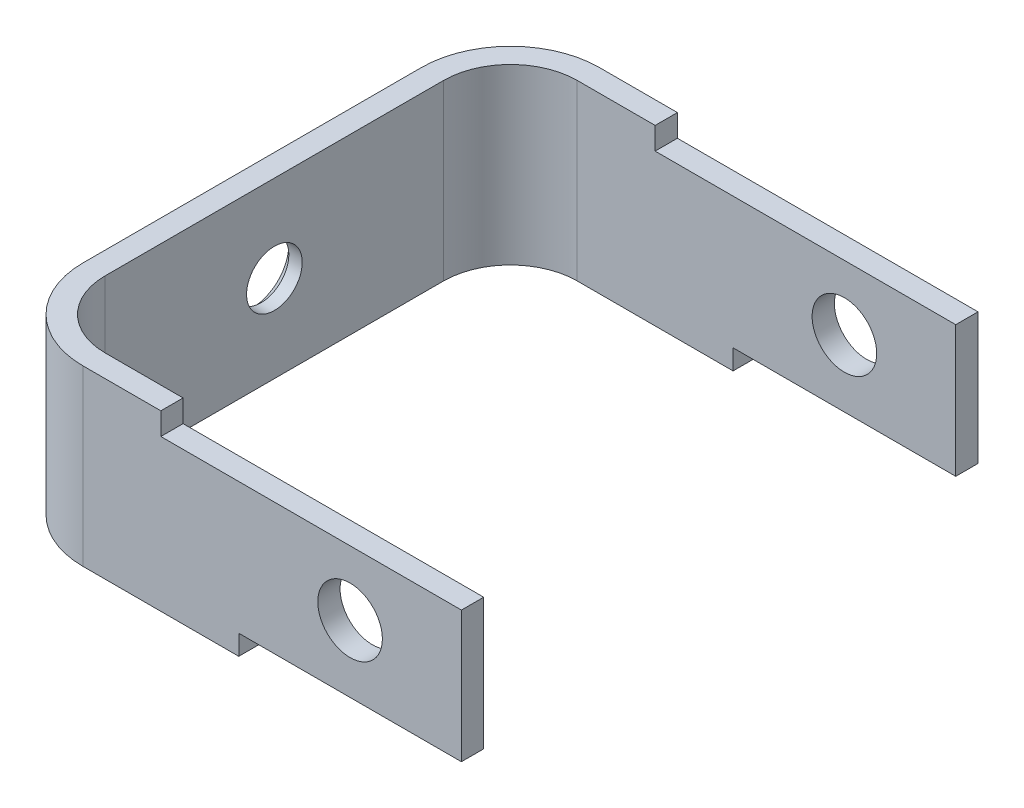
ISO-10303-21;
HEADER;
FILE_DESCRIPTION(('STEP AP214'),'2;1');
FILE_NAME('part.step','',(''),(''),'','','');
FILE_SCHEMA(('AUTOMOTIVE_DESIGN { 1 0 10303 214 1 1 1 1 }'));
ENDSEC;
DATA;
#1=APPLICATION_CONTEXT('core data for automotive mechanical design processes');
#2=APPLICATION_PROTOCOL_DEFINITION('international standard','automotive_design',2000,#1);
#3=PRODUCT_CONTEXT('',#1,'mechanical');
#4=PRODUCT('Part','Part','',(#3));
#5=PRODUCT_RELATED_PRODUCT_CATEGORY('part','',(#4));
#6=PRODUCT_DEFINITION_FORMATION('','',#4);
#7=PRODUCT_DEFINITION_CONTEXT('part definition',#1,'design');
#8=PRODUCT_DEFINITION('design','',#6,#7);
#9=PRODUCT_DEFINITION_SHAPE('','',#8);
#10=(LENGTH_UNIT() NAMED_UNIT(*) SI_UNIT(.MILLI.,.METRE.));
#11=(NAMED_UNIT(*) PLANE_ANGLE_UNIT() SI_UNIT($,.RADIAN.));
#12=(NAMED_UNIT(*) SI_UNIT($,.STERADIAN.) SOLID_ANGLE_UNIT());
#13=UNCERTAINTY_MEASURE_WITH_UNIT(LENGTH_MEASURE(1.E-05),#10,'distance_accuracy_value','');
#14=(GEOMETRIC_REPRESENTATION_CONTEXT(3) GLOBAL_UNCERTAINTY_ASSIGNED_CONTEXT((#13)) GLOBAL_UNIT_ASSIGNED_CONTEXT((#10,
#11,#12)) REPRESENTATION_CONTEXT('',''));
#15=CARTESIAN_POINT('',(0.,0.,0.));
#16=DIRECTION('',(0.,0.,1.));
#17=DIRECTION('',(1.,0.,0.));
#18=AXIS2_PLACEMENT_3D('',#15,#16,#17);
#19=CARTESIAN_POINT('',(-8.87019692950902,-1.29210789558067,-14.));
#20=DIRECTION('',(0.,0.,1.));
#21=DIRECTION('',(1.,0.,0.));
#22=AXIS2_PLACEMENT_3D('',#19,#20,#21);
#23=CYLINDRICAL_SURFACE('',#22,1.45);
#24=CARTESIAN_POINT('',(-8.87019692950902,-1.29210789558067,-22.2));
#25=DIRECTION('',(0.,0.,1.));
#26=DIRECTION('',(1.,0.,0.));
#27=AXIS2_PLACEMENT_3D('',#24,#25,#26);
#28=CIRCLE('',#27,1.45);
#29=CARTESIAN_POINT('',(-7.42019692950902,-1.29210789558067,-22.2));
#30=VERTEX_POINT('',#29);
#31=EDGE_CURVE('E182',#30,#30,#28,.F.);
#32=ORIENTED_EDGE('',*,*,#31,.T.);
#33=EDGE_LOOP('',(#32));
#34=FACE_BOUND('',#33,.T.);
#35=CARTESIAN_POINT('',(-8.87019692950902,-1.29210789558067,-21.2));
#36=DIRECTION('',(0.,0.,1.));
#37=DIRECTION('',(1.,0.,0.));
#38=AXIS2_PLACEMENT_3D('',#35,#36,#37);
#39=CIRCLE('',#38,1.45);
#40=CARTESIAN_POINT('',(-7.42019692950902,-1.29210789558067,-21.2));
#41=VERTEX_POINT('',#40);
#42=EDGE_CURVE('E161',#41,#41,#39,.F.);
#43=ORIENTED_EDGE('',*,*,#42,.F.);
#44=EDGE_LOOP('',(#43));
#45=FACE_BOUND('',#44,.T.);
#46=ADVANCED_FACE('F16',(#34,#45),#23,.F.);
#47=CARTESIAN_POINT('',(-3.87019692950902,-4.29210789558067,1.));
#48=DIRECTION('',(0.,1.,0.));
#49=DIRECTION('',(0.,0.,1.));
#50=AXIS2_PLACEMENT_3D('',#47,#48,#49);
#51=PLANE('',#50);
#52=DIRECTION('',(0.,0.,-1.));
#53=VECTOR('',#52,1.);
#54=CARTESIAN_POINT('',(-3.87019692950902,-4.29210789558067,-21.2));
#55=LINE('',#54,#53);
#56=CARTESIAN_POINT('',(-3.87019692950902,-4.29210789558068,-21.2));
#57=VERTEX_POINT('',#56);
#58=CARTESIAN_POINT('',(-3.87019692950902,-4.29210789558068,-22.2));
#59=VERTEX_POINT('',#58);
#60=EDGE_CURVE('E274',#57,#59,#55,.T.);
#61=ORIENTED_EDGE('',*,*,#60,.F.);
#62=DIRECTION('',(1.,0.,0.));
#63=VECTOR('',#62,1.);
#64=CARTESIAN_POINT('',(-14.370196929509,-4.29210789558068,-21.2));
#65=LINE('',#64,#63);
#66=CARTESIAN_POINT('',(-13.870196929509,-4.29210789558068,-21.2));
#67=VERTEX_POINT('',#66);
#68=EDGE_CURVE('E160',#67,#57,#65,.T.);
#69=ORIENTED_EDGE('',*,*,#68,.F.);
#70=DIRECTION('',(0.,0.,1.));
#71=VECTOR('',#70,1.);
#72=CARTESIAN_POINT('',(-13.870196929509,-4.29210789558068,1.));
#73=LINE('',#72,#71);
#74=CARTESIAN_POINT('',(-13.870196929509,-4.29210789558068,-22.2));
#75=VERTEX_POINT('',#74);
#76=EDGE_CURVE('E174',#67,#75,#73,.F.);
#77=ORIENTED_EDGE('',*,*,#76,.T.);
#78=DIRECTION('',(1.,0.,0.));
#79=VECTOR('',#78,1.);
#80=CARTESIAN_POINT('',(-14.370196929509,-4.29210789558068,-22.2));
#81=LINE('',#80,#79);
#82=EDGE_CURVE('E293',#75,#59,#81,.T.);
#83=ORIENTED_EDGE('',*,*,#82,.T.);
#84=EDGE_LOOP('',(#61,#69,#77,#83));
#85=FACE_BOUND('',#84,.T.);
#86=ADVANCED_FACE('F446',(#85),#51,.F.);
#87=CARTESIAN_POINT('',(-3.87019692950902,-5.19210789558068,-21.2));
#88=DIRECTION('',(1.,0.,0.));
#89=DIRECTION('',(0.,0.,-1.));
#90=AXIS2_PLACEMENT_3D('',#87,#88,#89);
#91=PLANE('',#90);
#92=DIRECTION('',(0.,0.,1.));
#93=VECTOR('',#92,1.);
#94=CARTESIAN_POINT('',(-3.87019692950902,1.60789210441933,1.));
#95=LINE('',#94,#93);
#96=CARTESIAN_POINT('',(-3.87019692950902,1.60789210441933,-22.2));
#97=VERTEX_POINT('',#96);
#98=CARTESIAN_POINT('',(-3.87019692950902,1.60789210441933,-21.2));
#99=VERTEX_POINT('',#98);
#100=EDGE_CURVE('E260',#97,#99,#95,.T.);
#101=ORIENTED_EDGE('',*,*,#100,.T.);
#102=DIRECTION('',(0.,1.,0.));
#103=VECTOR('',#102,1.);
#104=CARTESIAN_POINT('',(-3.87019692950902,-1.29210789558068,-21.2));
#105=LINE('',#104,#103);
#106=EDGE_CURVE('E269',#57,#99,#105,.T.);
#107=ORIENTED_EDGE('',*,*,#106,.F.);
#108=ORIENTED_EDGE('',*,*,#60,.T.);
#109=DIRECTION('',(0.,1.,0.));
#110=VECTOR('',#109,1.);
#111=CARTESIAN_POINT('',(-3.87019692950902,-1.29210789558068,-22.2));
#112=LINE('',#111,#110);
#113=EDGE_CURVE('E296',#59,#97,#112,.T.);
#114=ORIENTED_EDGE('',*,*,#113,.T.);
#115=EDGE_LOOP('',(#101,#107,#108,#114));
#116=FACE_BOUND('',#115,.T.);
#117=ADVANCED_FACE('F452',(#116),#91,.T.);
#118=CARTESIAN_POINT('',(-17.370196929509,1.60789210441932,1.));
#119=DIRECTION('',(0.,-1.,0.));
#120=DIRECTION('',(1.,0.,0.));
#121=AXIS2_PLACEMENT_3D('',#118,#119,#120);
#122=PLANE('',#121);
#123=DIRECTION('',(0.,0.,1.));
#124=VECTOR('',#123,1.);
#125=CARTESIAN_POINT('',(-17.370196929509,1.60789210441932,1.));
#126=LINE('',#125,#124);
#127=CARTESIAN_POINT('',(-17.370196929509,1.60789210441932,-22.2));
#128=VERTEX_POINT('',#127);
#129=CARTESIAN_POINT('',(-17.370196929509,1.60789210441932,-21.2));
#130=VERTEX_POINT('',#129);
#131=EDGE_CURVE('E230',#128,#130,#126,.T.);
#132=ORIENTED_EDGE('',*,*,#131,.T.);
#133=DIRECTION('',(1.,0.,0.));
#134=VECTOR('',#133,1.);
#135=CARTESIAN_POINT('',(-14.370196929509,1.60789210441933,-21.2));
#136=LINE('',#135,#134);
#137=EDGE_CURVE('E217',#99,#130,#136,.F.);
#138=ORIENTED_EDGE('',*,*,#137,.F.);
#139=ORIENTED_EDGE('',*,*,#100,.F.);
#140=DIRECTION('',(1.,0.,0.));
#141=VECTOR('',#140,1.);
#142=CARTESIAN_POINT('',(-14.370196929509,1.60789210441933,-22.2));
#143=LINE('',#142,#141);
#144=EDGE_CURVE('E206',#97,#128,#143,.F.);
#145=ORIENTED_EDGE('',*,*,#144,.T.);
#146=EDGE_LOOP('',(#132,#138,#139,#145));
#147=FACE_BOUND('',#146,.T.);
#148=ADVANCED_FACE('F460',(#147),#122,.F.);
#149=CARTESIAN_POINT('',(-8.87019692950902,-1.29210789558067,-14.));
#150=DIRECTION('',(0.,0.,1.));
#151=DIRECTION('',(1.,0.,0.));
#152=AXIS2_PLACEMENT_3D('',#149,#150,#151);
#153=CYLINDRICAL_SURFACE('',#152,1.45);
#154=CARTESIAN_POINT('',(-8.87019692950902,-1.29210789558067,0.));
#155=DIRECTION('',(0.,0.,1.));
#156=DIRECTION('',(1.,0.,0.));
#157=AXIS2_PLACEMENT_3D('',#154,#155,#156);
#158=CIRCLE('',#157,1.45);
#159=CARTESIAN_POINT('',(-7.42019692950902,-1.29210789558067,0.));
#160=VERTEX_POINT('',#159);
#161=EDGE_CURVE('E216',#160,#160,#158,.F.);
#162=ORIENTED_EDGE('',*,*,#161,.T.);
#163=EDGE_LOOP('',(#162));
#164=FACE_BOUND('',#163,.T.);
#165=CARTESIAN_POINT('',(-8.87019692950902,-1.29210789558067,1.));
#166=DIRECTION('',(0.,0.,1.));
#167=DIRECTION('',(1.,0.,0.));
#168=AXIS2_PLACEMENT_3D('',#165,#166,#167);
#169=CIRCLE('',#168,1.45);
#170=CARTESIAN_POINT('',(-7.42019692950902,-1.29210789558067,1.));
#171=VERTEX_POINT('',#170);
#172=EDGE_CURVE('E19',#171,#171,#169,.F.);
#173=ORIENTED_EDGE('',*,*,#172,.F.);
#174=EDGE_LOOP('',(#173));
#175=FACE_BOUND('',#174,.T.);
#176=ADVANCED_FACE('F491',(#164,#175),#153,.F.);
#177=CARTESIAN_POINT('',(-3.87019692950902,-4.29210789558067,1.));
#178=DIRECTION('',(0.,1.,0.));
#179=DIRECTION('',(0.,0.,1.));
#180=AXIS2_PLACEMENT_3D('',#177,#178,#179);
#181=PLANE('',#180);
#182=DIRECTION('',(0.,0.,-1.));
#183=VECTOR('',#182,1.);
#184=CARTESIAN_POINT('',(-3.87019692950902,-4.29210789558067,0.));
#185=LINE('',#184,#183);
#186=CARTESIAN_POINT('',(-3.87019692950902,-4.29210789558068,1.));
#187=VERTEX_POINT('',#186);
#188=CARTESIAN_POINT('',(-3.87019692950902,-4.29210789558068,0.));
#189=VERTEX_POINT('',#188);
#190=EDGE_CURVE('E251',#187,#189,#185,.T.);
#191=ORIENTED_EDGE('',*,*,#190,.F.);
#192=DIRECTION('',(1.,0.,0.));
#193=VECTOR('',#192,1.);
#194=CARTESIAN_POINT('',(-14.370196929509,-4.29210789558068,1.));
#195=LINE('',#194,#193);
#196=CARTESIAN_POINT('',(-13.870196929509,-4.29210789558068,1.));
#197=VERTEX_POINT('',#196);
#198=EDGE_CURVE('E192',#197,#187,#195,.T.);
#199=ORIENTED_EDGE('',*,*,#198,.F.);
#200=DIRECTION('',(0.,0.,1.));
#201=VECTOR('',#200,1.);
#202=CARTESIAN_POINT('',(-13.870196929509,-4.29210789558068,1.));
#203=LINE('',#202,#201);
#204=CARTESIAN_POINT('',(-13.870196929509,-4.29210789558068,0.));
#205=VERTEX_POINT('',#204);
#206=EDGE_CURVE('E227',#197,#205,#203,.F.);
#207=ORIENTED_EDGE('',*,*,#206,.T.);
#208=DIRECTION('',(1.,0.,0.));
#209=VECTOR('',#208,1.);
#210=CARTESIAN_POINT('',(-14.370196929509,-4.29210789558068,0.));
#211=LINE('',#210,#209);
#212=EDGE_CURVE('E233',#205,#189,#211,.T.);
#213=ORIENTED_EDGE('',*,*,#212,.T.);
#214=EDGE_LOOP('',(#191,#199,#207,#213));
#215=FACE_BOUND('',#214,.T.);
#216=ADVANCED_FACE('F489',(#215),#181,.F.);
#217=CARTESIAN_POINT('',(-3.87019692950902,2.60789210441932,0.));
#218=DIRECTION('',(1.,0.,0.));
#219=DIRECTION('',(0.,0.,-1.));
#220=AXIS2_PLACEMENT_3D('',#217,#218,#219);
#221=PLANE('',#220);
#222=DIRECTION('',(0.,0.,1.));
#223=VECTOR('',#222,1.);
#224=CARTESIAN_POINT('',(-3.87019692950902,1.60789210441933,1.));
#225=LINE('',#224,#223);
#226=CARTESIAN_POINT('',(-3.87019692950902,1.60789210441933,0.));
#227=VERTEX_POINT('',#226);
#228=CARTESIAN_POINT('',(-3.87019692950902,1.60789210441933,1.));
#229=VERTEX_POINT('',#228);
#230=EDGE_CURVE('E242',#227,#229,#225,.T.);
#231=ORIENTED_EDGE('',*,*,#230,.T.);
#232=DIRECTION('',(0.,1.,0.));
#233=VECTOR('',#232,1.);
#234=CARTESIAN_POINT('',(-3.87019692950902,-1.29210789558068,1.));
#235=LINE('',#234,#233);
#236=EDGE_CURVE('E309',#187,#229,#235,.T.);
#237=ORIENTED_EDGE('',*,*,#236,.F.);
#238=ORIENTED_EDGE('',*,*,#190,.T.);
#239=DIRECTION('',(0.,1.,0.));
#240=VECTOR('',#239,1.);
#241=CARTESIAN_POINT('',(-3.87019692950902,-1.29210789558068,0.));
#242=LINE('',#241,#240);
#243=EDGE_CURVE('E236',#189,#227,#242,.T.);
#244=ORIENTED_EDGE('',*,*,#243,.T.);
#245=EDGE_LOOP('',(#231,#237,#238,#244));
#246=FACE_BOUND('',#245,.T.);
#247=ADVANCED_FACE('F487',(#246),#221,.T.);
#248=CARTESIAN_POINT('',(-17.370196929509,1.60789210441932,1.));
#249=DIRECTION('',(0.,-1.,0.));
#250=DIRECTION('',(1.,0.,0.));
#251=AXIS2_PLACEMENT_3D('',#248,#249,#250);
#252=PLANE('',#251);
#253=DIRECTION('',(0.,0.,1.));
#254=VECTOR('',#253,1.);
#255=CARTESIAN_POINT('',(-17.370196929509,1.60789210441932,1.));
#256=LINE('',#255,#254);
#257=CARTESIAN_POINT('',(-17.370196929509,1.60789210441932,0.));
#258=VERTEX_POINT('',#257);
#259=CARTESIAN_POINT('',(-17.370196929509,1.60789210441932,1.));
#260=VERTEX_POINT('',#259);
#261=EDGE_CURVE('E239',#258,#260,#256,.T.);
#262=ORIENTED_EDGE('',*,*,#261,.T.);
#263=DIRECTION('',(1.,0.,0.));
#264=VECTOR('',#263,1.);
#265=CARTESIAN_POINT('',(-14.370196929509,1.60789210441932,1.));
#266=LINE('',#265,#264);
#267=EDGE_CURVE('E197',#229,#260,#266,.F.);
#268=ORIENTED_EDGE('',*,*,#267,.F.);
#269=ORIENTED_EDGE('',*,*,#230,.F.);
#270=DIRECTION('',(1.,0.,0.));
#271=VECTOR('',#270,1.);
#272=CARTESIAN_POINT('',(-14.370196929509,1.60789210441932,0.));
#273=LINE('',#272,#271);
#274=EDGE_CURVE('E222',#227,#258,#273,.F.);
#275=ORIENTED_EDGE('',*,*,#274,.T.);
#276=EDGE_LOOP('',(#262,#268,#269,#275));
#277=FACE_BOUND('',#276,.T.);
#278=ADVANCED_FACE('F483',(#277),#252,.F.);
#279=CARTESIAN_POINT('',(-24.4701969293715,-1.29210789558068,-10.6));
#280=DIRECTION('',(-1.,0.,0.));
#281=DIRECTION('',(0.,-1.,0.));
#282=AXIS2_PLACEMENT_3D('',#279,#280,#281);
#283=CONICAL_SURFACE('',#282,1.24999999986758,0.785398163397448);
#284=CARTESIAN_POINT('',(-24.470196929509,-1.29210789558068,-10.6));
#285=DIRECTION('',(1.,0.,0.));
#286=DIRECTION('',(0.,0.,-1.));
#287=AXIS2_PLACEMENT_3D('',#284,#285,#286);
#288=CIRCLE('',#287,1.25);
#289=CARTESIAN_POINT('',(-24.470196929509,-1.29210789558068,-11.85));
#290=VERTEX_POINT('',#289);
#291=EDGE_CURVE('E144',#290,#290,#288,.T.);
#292=ORIENTED_EDGE('',*,*,#291,.T.);
#293=EDGE_LOOP('',(#292));
#294=FACE_BOUND('',#293,.T.);
#295=CARTESIAN_POINT('',(-24.8701969294984,-1.29210789558068,-10.6));
#296=DIRECTION('',(-1.,0.,0.));
#297=DIRECTION('',(0.,-1.,0.));
#298=AXIS2_PLACEMENT_3D('',#295,#296,#297);
#299=CIRCLE('',#298,1.64999999999454);
#300=CARTESIAN_POINT('',(-24.8701969294984,-2.94210789557522,-10.6));
#301=VERTEX_POINT('',#300);
#302=EDGE_CURVE('E183',#301,#301,#299,.T.);
#303=ORIENTED_EDGE('',*,*,#302,.T.);
#304=EDGE_LOOP('',(#303));
#305=FACE_BOUND('',#304,.T.);
#306=ADVANCED_FACE('F342',(#294,#305),#283,.F.);
#307=CARTESIAN_POINT('',(-17.370196929509,2.60789210441932,1.));
#308=DIRECTION('',(-1.,0.,0.));
#309=DIRECTION('',(0.,-1.,0.));
#310=AXIS2_PLACEMENT_3D('',#307,#308,#309);
#311=PLANE('',#310);
#312=DIRECTION('',(0.,0.,1.));
#313=VECTOR('',#312,1.);
#314=CARTESIAN_POINT('',(-17.370196929509,2.60789210441932,-21.2));
#315=LINE('',#314,#313);
#316=CARTESIAN_POINT('',(-17.370196929509,2.60789210441932,1.));
#317=VERTEX_POINT('',#316);
#318=CARTESIAN_POINT('',(-17.370196929509,2.60789210441932,0.));
#319=VERTEX_POINT('',#318);
#320=EDGE_CURVE('E138',#317,#319,#315,.F.);
#321=ORIENTED_EDGE('',*,*,#320,.F.);
#322=DIRECTION('',(0.,1.,0.));
#323=VECTOR('',#322,1.);
#324=CARTESIAN_POINT('',(-17.370196929509,-1.29210789558068,1.));
#325=LINE('',#324,#323);
#326=EDGE_CURVE('E188',#260,#317,#325,.T.);
#327=ORIENTED_EDGE('',*,*,#326,.F.);
#328=ORIENTED_EDGE('',*,*,#261,.F.);
#329=DIRECTION('',(0.,1.,0.));
#330=VECTOR('',#329,1.);
#331=CARTESIAN_POINT('',(-17.370196929509,-1.29210789558068,0.));
#332=LINE('',#331,#330);
#333=EDGE_CURVE('E145',#258,#319,#332,.T.);
#334=ORIENTED_EDGE('',*,*,#333,.T.);
#335=EDGE_LOOP('',(#321,#327,#328,#334));
#336=FACE_BOUND('',#335,.T.);
#337=ADVANCED_FACE('F478',(#336),#311,.F.);
#338=CARTESIAN_POINT('',(-17.370196929509,2.60789210441932,1.));
#339=DIRECTION('',(-1.,0.,0.));
#340=DIRECTION('',(0.,-1.,0.));
#341=AXIS2_PLACEMENT_3D('',#338,#339,#340);
#342=PLANE('',#341);
#343=DIRECTION('',(0.,0.,1.));
#344=VECTOR('',#343,1.);
#345=CARTESIAN_POINT('',(-17.370196929509,2.60789210441932,-21.2));
#346=LINE('',#345,#344);
#347=CARTESIAN_POINT('',(-17.370196929509,2.60789210441932,-21.2));
#348=VERTEX_POINT('',#347);
#349=CARTESIAN_POINT('',(-17.370196929509,2.60789210441932,-22.2));
#350=VERTEX_POINT('',#349);
#351=EDGE_CURVE('E131',#348,#350,#346,.F.);
#352=ORIENTED_EDGE('',*,*,#351,.F.);
#353=DIRECTION('',(0.,1.,0.));
#354=VECTOR('',#353,1.);
#355=CARTESIAN_POINT('',(-17.370196929509,-1.29210789558068,-21.2));
#356=LINE('',#355,#354);
#357=EDGE_CURVE('E213',#130,#348,#356,.T.);
#358=ORIENTED_EDGE('',*,*,#357,.F.);
#359=ORIENTED_EDGE('',*,*,#131,.F.);
#360=DIRECTION('',(0.,1.,0.));
#361=VECTOR('',#360,1.);
#362=CARTESIAN_POINT('',(-17.370196929509,-1.29210789558068,-22.2));
#363=LINE('',#362,#361);
#364=EDGE_CURVE('E179',#128,#350,#363,.T.);
#365=ORIENTED_EDGE('',*,*,#364,.T.);
#366=EDGE_LOOP('',(#352,#358,#359,#365));
#367=FACE_BOUND('',#366,.T.);
#368=ADVANCED_FACE('F465',(#367),#342,.F.);
#369=CARTESIAN_POINT('',(-13.870196929509,-4.29210789558068,1.));
#370=DIRECTION('',(-1.,0.,0.));
#371=DIRECTION('',(0.,-1.,0.));
#372=AXIS2_PLACEMENT_3D('',#369,#370,#371);
#373=PLANE('',#372);
#374=ORIENTED_EDGE('',*,*,#206,.F.);
#375=DIRECTION('',(0.,1.,0.));
#376=VECTOR('',#375,1.);
#377=CARTESIAN_POINT('',(-13.870196929509,-1.29210789558068,1.));
#378=LINE('',#377,#376);
#379=CARTESIAN_POINT('',(-13.870196929509,-5.19210789558068,1.));
#380=VERTEX_POINT('',#379);
#381=EDGE_CURVE('E189',#380,#197,#378,.T.);
#382=ORIENTED_EDGE('',*,*,#381,.F.);
#383=DIRECTION('',(0.,0.,-1.));
#384=VECTOR('',#383,1.);
#385=CARTESIAN_POINT('',(-13.870196929509,-5.19210789558068,-21.2));
#386=LINE('',#385,#384);
#387=CARTESIAN_POINT('',(-13.870196929509,-5.19210789558068,0.));
#388=VERTEX_POINT('',#387);
#389=EDGE_CURVE('E148',#388,#380,#386,.F.);
#390=ORIENTED_EDGE('',*,*,#389,.F.);
#391=DIRECTION('',(0.,1.,0.));
#392=VECTOR('',#391,1.);
#393=CARTESIAN_POINT('',(-13.870196929509,-1.29210789558068,0.));
#394=LINE('',#393,#392);
#395=EDGE_CURVE('E141',#388,#205,#394,.T.);
#396=ORIENTED_EDGE('',*,*,#395,.T.);
#397=EDGE_LOOP('',(#374,#382,#390,#396));
#398=FACE_BOUND('',#397,.T.);
#399=ADVANCED_FACE('F472',(#398),#373,.F.);
#400=CARTESIAN_POINT('',(-14.370196929509,-1.29210789558068,1.));
#401=DIRECTION('',(0.,0.,1.));
#402=DIRECTION('',(1.,0.,0.));
#403=AXIS2_PLACEMENT_3D('',#400,#401,#402);
#404=PLANE('',#403);
#405=DIRECTION('',(0.,-1.,0.));
#406=VECTOR('',#405,1.);
#407=CARTESIAN_POINT('',(-20.870196929509,-1.29210789558068,1.));
#408=LINE('',#407,#406);
#409=CARTESIAN_POINT('',(-20.870196929509,-5.19210789558068,1.));
#410=VERTEX_POINT('',#409);
#411=CARTESIAN_POINT('',(-20.870196929509,2.60789210441932,1.));
#412=VERTEX_POINT('',#411);
#413=EDGE_CURVE('E186',#410,#412,#408,.F.);
#414=ORIENTED_EDGE('',*,*,#413,.F.);
#415=DIRECTION('',(1.,0.,0.));
#416=VECTOR('',#415,1.);
#417=CARTESIAN_POINT('',(-24.870196929509,-5.19210789558068,1.));
#418=LINE('',#417,#416);
#419=EDGE_CURVE('E151',#380,#410,#418,.F.);
#420=ORIENTED_EDGE('',*,*,#419,.F.);
#421=ORIENTED_EDGE('',*,*,#381,.T.);
#422=ORIENTED_EDGE('',*,*,#198,.T.);
#423=ORIENTED_EDGE('',*,*,#236,.T.);
#424=ORIENTED_EDGE('',*,*,#267,.T.);
#425=ORIENTED_EDGE('',*,*,#326,.T.);
#426=DIRECTION('',(1.,0.,0.));
#427=VECTOR('',#426,1.);
#428=CARTESIAN_POINT('',(-3.87019692950902,2.60789210441932,1.));
#429=LINE('',#428,#427);
#430=EDGE_CURVE('E118',#412,#317,#429,.T.);
#431=ORIENTED_EDGE('',*,*,#430,.F.);
#432=EDGE_LOOP('',(#414,#420,#421,#422,#423,#424,#425,#431));
#433=FACE_BOUND('',#432,.T.);
#434=ORIENTED_EDGE('',*,*,#172,.T.);
#435=EDGE_LOOP('',(#434));
#436=FACE_BOUND('',#435,.T.);
#437=ADVANCED_FACE('F475',(#433,#436),#404,.T.);
#438=CARTESIAN_POINT('',(-20.870196929509,-1.29210789558068,-3.));
#439=DIRECTION('',(0.,-1.,0.));
#440=DIRECTION('',(0.,0.,-1.));
#441=AXIS2_PLACEMENT_3D('',#438,#439,#440);
#442=CYLINDRICAL_SURFACE('',#441,4.);
#443=ORIENTED_EDGE('',*,*,#413,.T.);
#444=CARTESIAN_POINT('',(-20.870196929509,2.60789210441932,-3.));
#445=DIRECTION('',(0.,-1.,0.));
#446=DIRECTION('',(0.,0.,-1.));
#447=AXIS2_PLACEMENT_3D('',#444,#445,#446);
#448=CIRCLE('',#447,4.);
#449=CARTESIAN_POINT('',(-24.870196929509,2.60789210441932,-3.));
#450=VERTEX_POINT('',#449);
#451=EDGE_CURVE('E121',#450,#412,#448,.F.);
#452=ORIENTED_EDGE('',*,*,#451,.F.);
#453=DIRECTION('',(0.,1.,0.));
#454=VECTOR('',#453,1.);
#455=CARTESIAN_POINT('',(-24.870196929509,-1.29210789558068,-3.));
#456=LINE('',#455,#454);
#457=CARTESIAN_POINT('',(-24.870196929509,-5.19210789558068,-3.));
#458=VERTEX_POINT('',#457);
#459=EDGE_CURVE('E184',#450,#458,#456,.F.);
#460=ORIENTED_EDGE('',*,*,#459,.T.);
#461=CARTESIAN_POINT('',(-20.870196929509,-5.19210789558068,-3.));
#462=DIRECTION('',(0.,-1.,0.));
#463=DIRECTION('',(0.,0.,-1.));
#464=AXIS2_PLACEMENT_3D('',#461,#462,#463);
#465=CIRCLE('',#464,4.);
#466=EDGE_CURVE('E327',#410,#458,#465,.T.);
#467=ORIENTED_EDGE('',*,*,#466,.F.);
#468=EDGE_LOOP('',(#443,#452,#460,#467));
#469=FACE_BOUND('',#468,.T.);
#470=ADVANCED_FACE('F348',(#469),#442,.T.);
#471=CARTESIAN_POINT('',(-24.870196929509,-1.29210789558068,-10.6));
#472=DIRECTION('',(1.,0.,0.));
#473=DIRECTION('',(0.,0.,-1.));
#474=AXIS2_PLACEMENT_3D('',#471,#472,#473);
#475=PLANE('',#474);
#476=ORIENTED_EDGE('',*,*,#302,.F.);
#477=EDGE_LOOP('',(#476));
#478=FACE_BOUND('',#477,.T.);
#479=DIRECTION('',(0.,0.,-1.));
#480=VECTOR('',#479,1.);
#481=CARTESIAN_POINT('',(-24.870196929509,-5.19210789558068,-21.2));
#482=LINE('',#481,#480);
#483=CARTESIAN_POINT('',(-24.870196929509,-5.19210789558068,-18.2));
#484=VERTEX_POINT('',#483);
#485=EDGE_CURVE('E326',#458,#484,#482,.T.);
#486=ORIENTED_EDGE('',*,*,#485,.F.);
#487=ORIENTED_EDGE('',*,*,#459,.F.);
#488=DIRECTION('',(0.,0.,1.));
#489=VECTOR('',#488,1.);
#490=CARTESIAN_POINT('',(-24.870196929509,2.60789210441932,-21.2));
#491=LINE('',#490,#489);
#492=CARTESIAN_POINT('',(-24.870196929509,2.60789210441932,-18.2));
#493=VERTEX_POINT('',#492);
#494=EDGE_CURVE('E124',#493,#450,#491,.T.);
#495=ORIENTED_EDGE('',*,*,#494,.F.);
#496=DIRECTION('',(0.,-1.,0.));
#497=VECTOR('',#496,1.);
#498=CARTESIAN_POINT('',(-24.870196929509,-1.29210789558068,-18.2));
#499=LINE('',#498,#497);
#500=EDGE_CURVE('E180',#484,#493,#499,.F.);
#501=ORIENTED_EDGE('',*,*,#500,.F.);
#502=EDGE_LOOP('',(#486,#487,#495,#501));
#503=FACE_BOUND('',#502,.T.);
#504=ADVANCED_FACE('F344',(#478,#503),#475,.F.);
#505=CARTESIAN_POINT('',(-20.870196929509,-1.29210789558068,-18.2));
#506=DIRECTION('',(0.,-1.,0.));
#507=DIRECTION('',(1.,0.,0.));
#508=AXIS2_PLACEMENT_3D('',#505,#506,#507);
#509=CYLINDRICAL_SURFACE('',#508,4.);
#510=ORIENTED_EDGE('',*,*,#500,.T.);
#511=CARTESIAN_POINT('',(-20.870196929509,2.60789210441932,-18.2));
#512=DIRECTION('',(0.,-1.,0.));
#513=DIRECTION('',(1.,0.,0.));
#514=AXIS2_PLACEMENT_3D('',#511,#512,#513);
#515=CIRCLE('',#514,4.);
#516=CARTESIAN_POINT('',(-20.870196929509,2.60789210441932,-22.2));
#517=VERTEX_POINT('',#516);
#518=EDGE_CURVE('E127',#517,#493,#515,.F.);
#519=ORIENTED_EDGE('',*,*,#518,.F.);
#520=DIRECTION('',(0.,1.,0.));
#521=VECTOR('',#520,1.);
#522=CARTESIAN_POINT('',(-20.870196929509,-1.29210789558068,-22.2));
#523=LINE('',#522,#521);
#524=CARTESIAN_POINT('',(-20.870196929509,-5.19210789558068,-22.2));
#525=VERTEX_POINT('',#524);
#526=EDGE_CURVE('E177',#517,#525,#523,.F.);
#527=ORIENTED_EDGE('',*,*,#526,.T.);
#528=CARTESIAN_POINT('',(-20.870196929509,-5.19210789558068,-18.2));
#529=DIRECTION('',(0.,-1.,0.));
#530=DIRECTION('',(1.,0.,0.));
#531=AXIS2_PLACEMENT_3D('',#528,#529,#530);
#532=CIRCLE('',#531,4.);
#533=EDGE_CURVE('E323',#484,#525,#532,.T.);
#534=ORIENTED_EDGE('',*,*,#533,.F.);
#535=EDGE_LOOP('',(#510,#519,#527,#534));
#536=FACE_BOUND('',#535,.T.);
#537=ADVANCED_FACE('F347',(#536),#509,.T.);
#538=CARTESIAN_POINT('',(-14.370196929509,-1.29210789558068,-22.2));
#539=DIRECTION('',(0.,0.,1.));
#540=DIRECTION('',(1.,0.,0.));
#541=AXIS2_PLACEMENT_3D('',#538,#539,#540);
#542=PLANE('',#541);
#543=DIRECTION('',(1.,0.,0.));
#544=VECTOR('',#543,1.);
#545=CARTESIAN_POINT('',(-24.870196929509,-5.19210789558068,-22.2));
#546=LINE('',#545,#544);
#547=CARTESIAN_POINT('',(-13.870196929509,-5.19210789558068,-22.2));
#548=VERTEX_POINT('',#547);
#549=EDGE_CURVE('E168',#525,#548,#546,.T.);
#550=ORIENTED_EDGE('',*,*,#549,.F.);
#551=ORIENTED_EDGE('',*,*,#526,.F.);
#552=DIRECTION('',(1.,0.,0.));
#553=VECTOR('',#552,1.);
#554=CARTESIAN_POINT('',(-3.87019692950902,2.60789210441932,-22.2));
#555=LINE('',#554,#553);
#556=EDGE_CURVE('E128',#350,#517,#555,.F.);
#557=ORIENTED_EDGE('',*,*,#556,.F.);
#558=ORIENTED_EDGE('',*,*,#364,.F.);
#559=ORIENTED_EDGE('',*,*,#144,.F.);
#560=ORIENTED_EDGE('',*,*,#113,.F.);
#561=ORIENTED_EDGE('',*,*,#82,.F.);
#562=DIRECTION('',(0.,-1.,0.));
#563=VECTOR('',#562,1.);
#564=CARTESIAN_POINT('',(-13.870196929509,-4.29210789558068,-22.2));
#565=LINE('',#564,#563);
#566=EDGE_CURVE('E171',#75,#548,#565,.T.);
#567=ORIENTED_EDGE('',*,*,#566,.T.);
#568=EDGE_LOOP('',(#550,#551,#557,#558,#559,#560,#561,#567));
#569=FACE_BOUND('',#568,.T.);
#570=ORIENTED_EDGE('',*,*,#31,.F.);
#571=EDGE_LOOP('',(#570));
#572=FACE_BOUND('',#571,.T.);
#573=ADVANCED_FACE('F455',(#569,#572),#542,.F.);
#574=CARTESIAN_POINT('',(-13.870196929509,-4.29210789558068,1.));
#575=DIRECTION('',(-1.,0.,0.));
#576=DIRECTION('',(0.,-1.,0.));
#577=AXIS2_PLACEMENT_3D('',#574,#575,#576);
#578=PLANE('',#577);
#579=ORIENTED_EDGE('',*,*,#76,.F.);
#580=DIRECTION('',(0.,1.,0.));
#581=VECTOR('',#580,1.);
#582=CARTESIAN_POINT('',(-13.870196929509,-1.29210789558068,-21.2));
#583=LINE('',#582,#581);
#584=CARTESIAN_POINT('',(-13.870196929509,-5.19210789558068,-21.2));
#585=VERTEX_POINT('',#584);
#586=EDGE_CURVE('E157',#585,#67,#583,.T.);
#587=ORIENTED_EDGE('',*,*,#586,.F.);
#588=DIRECTION('',(0.,0.,-1.));
#589=VECTOR('',#588,1.);
#590=CARTESIAN_POINT('',(-13.870196929509,-5.19210789558068,-21.2));
#591=LINE('',#590,#589);
#592=EDGE_CURVE('E164',#548,#585,#591,.F.);
#593=ORIENTED_EDGE('',*,*,#592,.F.);
#594=ORIENTED_EDGE('',*,*,#566,.F.);
#595=EDGE_LOOP('',(#579,#587,#593,#594));
#596=FACE_BOUND('',#595,.T.);
#597=ADVANCED_FACE('F522',(#596),#578,.F.);
#598=CARTESIAN_POINT('',(-14.370196929509,-1.29210789558068,-21.2));
#599=DIRECTION('',(0.,0.,1.));
#600=DIRECTION('',(1.,0.,0.));
#601=AXIS2_PLACEMENT_3D('',#598,#599,#600);
#602=PLANE('',#601);
#603=DIRECTION('',(0.,-1.,0.));
#604=VECTOR('',#603,1.);
#605=CARTESIAN_POINT('',(-20.870196929509,-1.29210789558068,-21.2));
#606=LINE('',#605,#604);
#607=CARTESIAN_POINT('',(-20.870196929509,-5.19210789558068,-21.2));
#608=VERTEX_POINT('',#607);
#609=CARTESIAN_POINT('',(-20.870196929509,2.60789210441932,-21.2));
#610=VERTEX_POINT('',#609);
#611=EDGE_CURVE('E93',#608,#610,#606,.F.);
#612=ORIENTED_EDGE('',*,*,#611,.F.);
#613=DIRECTION('',(1.,0.,0.));
#614=VECTOR('',#613,1.);
#615=CARTESIAN_POINT('',(-24.870196929509,-5.19210789558068,-21.2));
#616=LINE('',#615,#614);
#617=EDGE_CURVE('E167',#585,#608,#616,.F.);
#618=ORIENTED_EDGE('',*,*,#617,.F.);
#619=ORIENTED_EDGE('',*,*,#586,.T.);
#620=ORIENTED_EDGE('',*,*,#68,.T.);
#621=ORIENTED_EDGE('',*,*,#106,.T.);
#622=ORIENTED_EDGE('',*,*,#137,.T.);
#623=ORIENTED_EDGE('',*,*,#357,.T.);
#624=DIRECTION('',(1.,0.,0.));
#625=VECTOR('',#624,1.);
#626=CARTESIAN_POINT('',(-3.87019692950902,2.60789210441932,-21.2));
#627=LINE('',#626,#625);
#628=EDGE_CURVE('E97',#610,#348,#627,.T.);
#629=ORIENTED_EDGE('',*,*,#628,.F.);
#630=EDGE_LOOP('',(#612,#618,#619,#620,#621,#622,#623,#629));
#631=FACE_BOUND('',#630,.T.);
#632=ORIENTED_EDGE('',*,*,#42,.T.);
#633=EDGE_LOOP('',(#632));
#634=FACE_BOUND('',#633,.T.);
#635=ADVANCED_FACE('F396',(#631,#634),#602,.T.);
#636=CARTESIAN_POINT('',(-14.370196929509,-1.29210789558068,0.));
#637=DIRECTION('',(0.,0.,1.));
#638=DIRECTION('',(1.,0.,0.));
#639=AXIS2_PLACEMENT_3D('',#636,#637,#638);
#640=PLANE('',#639);
#641=DIRECTION('',(1.,0.,0.));
#642=VECTOR('',#641,1.);
#643=CARTESIAN_POINT('',(-24.870196929509,-5.19210789558068,0.));
#644=LINE('',#643,#642);
#645=CARTESIAN_POINT('',(-20.870196929509,-5.19210789558068,0.));
#646=VERTEX_POINT('',#645);
#647=EDGE_CURVE('E114',#646,#388,#644,.T.);
#648=ORIENTED_EDGE('',*,*,#647,.F.);
#649=DIRECTION('',(0.,-1.,0.));
#650=VECTOR('',#649,1.);
#651=CARTESIAN_POINT('',(-20.870196929509,-1.29210789558068,0.));
#652=LINE('',#651,#650);
#653=CARTESIAN_POINT('',(-20.870196929509,2.60789210441932,0.));
#654=VERTEX_POINT('',#653);
#655=EDGE_CURVE('E152',#654,#646,#652,.T.);
#656=ORIENTED_EDGE('',*,*,#655,.F.);
#657=DIRECTION('',(1.,0.,0.));
#658=VECTOR('',#657,1.);
#659=CARTESIAN_POINT('',(-3.87019692950902,2.60789210441932,0.));
#660=LINE('',#659,#658);
#661=EDGE_CURVE('E98',#319,#654,#660,.F.);
#662=ORIENTED_EDGE('',*,*,#661,.F.);
#663=ORIENTED_EDGE('',*,*,#333,.F.);
#664=ORIENTED_EDGE('',*,*,#274,.F.);
#665=ORIENTED_EDGE('',*,*,#243,.F.);
#666=ORIENTED_EDGE('',*,*,#212,.F.);
#667=ORIENTED_EDGE('',*,*,#395,.F.);
#668=EDGE_LOOP('',(#648,#656,#662,#663,#664,#665,#666,#667));
#669=FACE_BOUND('',#668,.T.);
#670=ORIENTED_EDGE('',*,*,#161,.F.);
#671=EDGE_LOOP('',(#670));
#672=FACE_BOUND('',#671,.T.);
#673=ADVANCED_FACE('F388',(#669,#672),#640,.F.);
#674=CARTESIAN_POINT('',(-38.870196929509,-1.29210789558068,-10.6));
#675=DIRECTION('',(1.,0.,0.));
#676=DIRECTION('',(0.,0.,-1.));
#677=AXIS2_PLACEMENT_3D('',#674,#675,#676);
#678=CYLINDRICAL_SURFACE('',#677,1.25);
#679=CARTESIAN_POINT('',(-23.870196929509,-1.29210789558068,-10.6));
#680=DIRECTION('',(1.,0.,0.));
#681=DIRECTION('',(0.,0.,-1.));
#682=AXIS2_PLACEMENT_3D('',#679,#680,#681);
#683=CIRCLE('',#682,1.25);
#684=CARTESIAN_POINT('',(-23.870196929509,-1.29210789558068,-11.85));
#685=VERTEX_POINT('',#684);
#686=EDGE_CURVE('E111',#685,#685,#683,.F.);
#687=ORIENTED_EDGE('',*,*,#686,.F.);
#688=EDGE_LOOP('',(#687));
#689=FACE_BOUND('',#688,.T.);
#690=ORIENTED_EDGE('',*,*,#291,.F.);
#691=EDGE_LOOP('',(#690));
#692=FACE_BOUND('',#691,.T.);
#693=ADVANCED_FACE('F514',(#689,#692),#678,.F.);
#694=CARTESIAN_POINT('',(-20.870196929509,2.60789210441932,-18.2));
#695=DIRECTION('',(0.,-1.,0.));
#696=DIRECTION('',(0.,0.,-1.));
#697=AXIS2_PLACEMENT_3D('',#694,#695,#696);
#698=CYLINDRICAL_SURFACE('',#697,3.);
#699=DIRECTION('',(0.,1.,0.));
#700=VECTOR('',#699,1.);
#701=CARTESIAN_POINT('',(-23.870196929509,-1.29210789558068,-18.2));
#702=LINE('',#701,#700);
#703=CARTESIAN_POINT('',(-23.870196929509,-5.19210789558068,-18.2));
#704=VERTEX_POINT('',#703);
#705=CARTESIAN_POINT('',(-23.870196929509,2.60789210441932,-18.2));
#706=VERTEX_POINT('',#705);
#707=EDGE_CURVE('E91',#704,#706,#702,.T.);
#708=ORIENTED_EDGE('',*,*,#707,.F.);
#709=CARTESIAN_POINT('',(-20.870196929509,-5.19210789558068,-18.2));
#710=DIRECTION('',(0.,-1.,0.));
#711=DIRECTION('',(0.,0.,-1.));
#712=AXIS2_PLACEMENT_3D('',#709,#710,#711);
#713=CIRCLE('',#712,3.);
#714=EDGE_CURVE('E321',#608,#704,#713,.F.);
#715=ORIENTED_EDGE('',*,*,#714,.F.);
#716=ORIENTED_EDGE('',*,*,#611,.T.);
#717=CARTESIAN_POINT('',(-20.870196929509,2.60789210441932,-18.2));
#718=DIRECTION('',(0.,-1.,0.));
#719=DIRECTION('',(0.,0.,-1.));
#720=AXIS2_PLACEMENT_3D('',#717,#718,#719);
#721=CIRCLE('',#720,3.);
#722=EDGE_CURVE('E86',#706,#610,#721,.T.);
#723=ORIENTED_EDGE('',*,*,#722,.F.);
#724=EDGE_LOOP('',(#708,#715,#716,#723));
#725=FACE_BOUND('',#724,.T.);
#726=ADVANCED_FACE('F88',(#725),#698,.F.);
#727=CARTESIAN_POINT('',(-3.87019692950902,2.60789210441932,-21.2));
#728=DIRECTION('',(0.,1.,0.));
#729=DIRECTION('',(0.,0.,1.));
#730=AXIS2_PLACEMENT_3D('',#727,#728,#729);
#731=PLANE('',#730);
#732=ORIENTED_EDGE('',*,*,#451,.T.);
#733=ORIENTED_EDGE('',*,*,#430,.T.);
#734=ORIENTED_EDGE('',*,*,#320,.T.);
#735=ORIENTED_EDGE('',*,*,#661,.T.);
#736=CARTESIAN_POINT('',(-20.870196929509,2.60789210441932,-3.));
#737=DIRECTION('',(0.,-1.,0.));
#738=DIRECTION('',(0.,0.,-1.));
#739=AXIS2_PLACEMENT_3D('',#736,#737,#738);
#740=CIRCLE('',#739,3.);
#741=CARTESIAN_POINT('',(-23.870196929509,2.60789210441932,-3.));
#742=VERTEX_POINT('',#741);
#743=EDGE_CURVE('E105',#742,#654,#740,.F.);
#744=ORIENTED_EDGE('',*,*,#743,.F.);
#745=DIRECTION('',(0.,0.,-1.));
#746=VECTOR('',#745,1.);
#747=CARTESIAN_POINT('',(-23.870196929509,2.60789210441932,-10.6));
#748=LINE('',#747,#746);
#749=EDGE_CURVE('E101',#706,#742,#748,.F.);
#750=ORIENTED_EDGE('',*,*,#749,.F.);
#751=ORIENTED_EDGE('',*,*,#722,.T.);
#752=ORIENTED_EDGE('',*,*,#628,.T.);
#753=ORIENTED_EDGE('',*,*,#351,.T.);
#754=ORIENTED_EDGE('',*,*,#556,.T.);
#755=ORIENTED_EDGE('',*,*,#518,.T.);
#756=ORIENTED_EDGE('',*,*,#494,.T.);
#757=EDGE_LOOP('',(#732,#733,#734,#735,#744,#750,#751,#752,#753,#754,#755,#756));
#758=FACE_BOUND('',#757,.T.);
#759=ADVANCED_FACE('F103',(#758),#731,.T.);
#760=CARTESIAN_POINT('',(-20.870196929509,2.60789210441932,-3.));
#761=DIRECTION('',(0.,-1.,0.));
#762=DIRECTION('',(0.,0.,-1.));
#763=AXIS2_PLACEMENT_3D('',#760,#761,#762);
#764=CYLINDRICAL_SURFACE('',#763,3.);
#765=ORIENTED_EDGE('',*,*,#655,.T.);
#766=CARTESIAN_POINT('',(-20.870196929509,-5.19210789558068,-3.));
#767=DIRECTION('',(0.,-1.,0.));
#768=DIRECTION('',(0.,0.,-1.));
#769=AXIS2_PLACEMENT_3D('',#766,#767,#768);
#770=CIRCLE('',#769,3.);
#771=CARTESIAN_POINT('',(-23.870196929509,-5.19210789558068,-3.));
#772=VERTEX_POINT('',#771);
#773=EDGE_CURVE('E34',#772,#646,#770,.F.);
#774=ORIENTED_EDGE('',*,*,#773,.F.);
#775=DIRECTION('',(0.,1.,0.));
#776=VECTOR('',#775,1.);
#777=CARTESIAN_POINT('',(-23.870196929509,-1.29210789558068,-3.));
#778=LINE('',#777,#776);
#779=EDGE_CURVE('E25',#742,#772,#778,.F.);
#780=ORIENTED_EDGE('',*,*,#779,.F.);
#781=ORIENTED_EDGE('',*,*,#743,.T.);
#782=EDGE_LOOP('',(#765,#774,#780,#781));
#783=FACE_BOUND('',#782,.T.);
#784=ADVANCED_FACE('F381',(#783),#764,.F.);
#785=CARTESIAN_POINT('',(-24.870196929509,-5.19210789558068,-21.2));
#786=DIRECTION('',(0.,-1.,0.));
#787=DIRECTION('',(0.,0.,-1.));
#788=AXIS2_PLACEMENT_3D('',#785,#786,#787);
#789=PLANE('',#788);
#790=ORIENTED_EDGE('',*,*,#773,.T.);
#791=ORIENTED_EDGE('',*,*,#647,.T.);
#792=ORIENTED_EDGE('',*,*,#389,.T.);
#793=ORIENTED_EDGE('',*,*,#419,.T.);
#794=ORIENTED_EDGE('',*,*,#466,.T.);
#795=ORIENTED_EDGE('',*,*,#485,.T.);
#796=ORIENTED_EDGE('',*,*,#533,.T.);
#797=ORIENTED_EDGE('',*,*,#549,.T.);
#798=ORIENTED_EDGE('',*,*,#592,.T.);
#799=ORIENTED_EDGE('',*,*,#617,.T.);
#800=ORIENTED_EDGE('',*,*,#714,.T.);
#801=DIRECTION('',(0.,0.,-1.));
#802=VECTOR('',#801,1.);
#803=CARTESIAN_POINT('',(-23.870196929509,-5.19210789558068,-10.6));
#804=LINE('',#803,#802);
#805=EDGE_CURVE('E10',#772,#704,#804,.T.);
#806=ORIENTED_EDGE('',*,*,#805,.F.);
#807=EDGE_LOOP('',(#790,#791,#792,#793,#794,#795,#796,#797,#798,#799,#800,#806));
#808=FACE_BOUND('',#807,.T.);
#809=ADVANCED_FACE('F359',(#808),#789,.T.);
#810=CARTESIAN_POINT('',(-23.870196929509,-1.29210789558068,-10.6));
#811=DIRECTION('',(1.,0.,0.));
#812=DIRECTION('',(0.,0.,-1.));
#813=AXIS2_PLACEMENT_3D('',#810,#811,#812);
#814=PLANE('',#813);
#815=ORIENTED_EDGE('',*,*,#779,.T.);
#816=ORIENTED_EDGE('',*,*,#805,.T.);
#817=ORIENTED_EDGE('',*,*,#707,.T.);
#818=ORIENTED_EDGE('',*,*,#749,.T.);
#819=EDGE_LOOP('',(#815,#816,#817,#818));
#820=FACE_BOUND('',#819,.T.);
#821=ORIENTED_EDGE('',*,*,#686,.T.);
#822=EDGE_LOOP('',(#821));
#823=FACE_BOUND('',#822,.T.);
#824=ADVANCED_FACE('F109',(#820,#823),#814,.T.);
#825=CLOSED_SHELL('',(#46,#86,#117,#148,#176,#216,#247,#278,#306,#337,#368,#399,#437,#470,#504,
#537,#573,#597,#635,#673,#693,#726,#759,#784,#809,#824));
#826=MANIFOLD_SOLID_BREP('B1',#825);
#827=ADVANCED_BREP_SHAPE_REPRESENTATION('',(#18,#826),#14);
#828=SHAPE_DEFINITION_REPRESENTATION(#9,#827);
ENDSEC;
END-ISO-10303-21;
